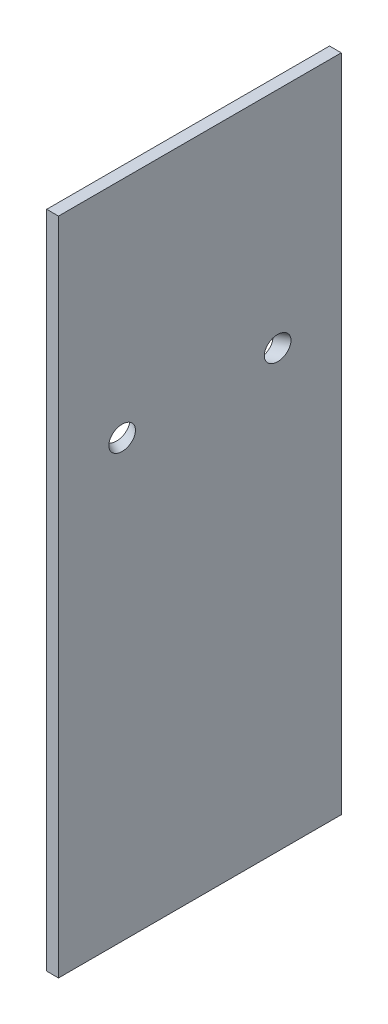
ISO-10303-21;
HEADER;
FILE_DESCRIPTION(('STEP AP214'),'2;1');
FILE_NAME('part.step','',(''),(''),'','','');
FILE_SCHEMA(('AUTOMOTIVE_DESIGN { 1 0 10303 214 1 1 1 1 }'));
ENDSEC;
DATA;
#1=APPLICATION_CONTEXT('core data for automotive mechanical design processes');
#2=APPLICATION_PROTOCOL_DEFINITION('international standard','automotive_design',2000,#1);
#3=PRODUCT_CONTEXT('',#1,'mechanical');
#4=PRODUCT('Part','Part','',(#3));
#5=PRODUCT_RELATED_PRODUCT_CATEGORY('part','',(#4));
#6=PRODUCT_DEFINITION_FORMATION('','',#4);
#7=PRODUCT_DEFINITION_CONTEXT('part definition',#1,'design');
#8=PRODUCT_DEFINITION('design','',#6,#7);
#9=PRODUCT_DEFINITION_SHAPE('','',#8);
#10=(LENGTH_UNIT() NAMED_UNIT(*) SI_UNIT(.MILLI.,.METRE.));
#11=(NAMED_UNIT(*) PLANE_ANGLE_UNIT() SI_UNIT($,.RADIAN.));
#12=(NAMED_UNIT(*) SI_UNIT($,.STERADIAN.) SOLID_ANGLE_UNIT());
#13=UNCERTAINTY_MEASURE_WITH_UNIT(LENGTH_MEASURE(1.E-05),#10,'distance_accuracy_value','');
#14=(GEOMETRIC_REPRESENTATION_CONTEXT(3) GLOBAL_UNCERTAINTY_ASSIGNED_CONTEXT((#13)) GLOBAL_UNIT_ASSIGNED_CONTEXT((#10,
#11,#12)) REPRESENTATION_CONTEXT('',''));
#15=CARTESIAN_POINT('',(0.,0.,0.));
#16=DIRECTION('',(0.,0.,1.));
#17=DIRECTION('',(1.,0.,0.));
#18=AXIS2_PLACEMENT_3D('',#15,#16,#17);
#19=CARTESIAN_POINT('',(6.35,355.6,-152.4));
#20=DIRECTION('',(0.,0.,1.));
#21=DIRECTION('',(0.,-1.,0.));
#22=AXIS2_PLACEMENT_3D('',#19,#20,#21);
#23=PLANE('',#22);
#24=DIRECTION('',(0.,1.,0.));
#25=VECTOR('',#24,1.);
#26=CARTESIAN_POINT('',(-6.35,355.6,-152.4));
#27=LINE('',#26,#25);
#28=CARTESIAN_POINT('',(-6.35,-355.6,-152.4));
#29=VERTEX_POINT('',#28);
#30=CARTESIAN_POINT('',(-6.35,355.6,-152.4));
#31=VERTEX_POINT('',#30);
#32=EDGE_CURVE('E115',#29,#31,#27,.T.);
#33=ORIENTED_EDGE('',*,*,#32,.T.);
#34=DIRECTION('',(-1.,0.,0.));
#35=VECTOR('',#34,1.);
#36=CARTESIAN_POINT('',(6.35,355.6,-152.4));
#37=LINE('',#36,#35);
#38=CARTESIAN_POINT('',(6.35,355.6,-152.4));
#39=VERTEX_POINT('',#38);
#40=EDGE_CURVE('E102',#39,#31,#37,.T.);
#41=ORIENTED_EDGE('',*,*,#40,.F.);
#42=DIRECTION('',(0.,1.,0.));
#43=VECTOR('',#42,1.);
#44=CARTESIAN_POINT('',(6.35,355.6,-152.4));
#45=LINE('',#44,#43);
#46=CARTESIAN_POINT('',(6.35,-355.6,-152.4));
#47=VERTEX_POINT('',#46);
#48=EDGE_CURVE('E121',#47,#39,#45,.T.);
#49=ORIENTED_EDGE('',*,*,#48,.F.);
#50=DIRECTION('',(-1.,0.,0.));
#51=VECTOR('',#50,1.);
#52=CARTESIAN_POINT('',(6.35,-355.6,-152.4));
#53=LINE('',#52,#51);
#54=EDGE_CURVE('E104',#47,#29,#53,.T.);
#55=ORIENTED_EDGE('',*,*,#54,.T.);
#56=EDGE_LOOP('',(#33,#41,#49,#55));
#57=FACE_BOUND('',#56,.T.);
#58=ADVANCED_FACE('F46',(#57),#23,.F.);
#59=CARTESIAN_POINT('',(6.35,355.6,152.4));
#60=DIRECTION('',(0.,-1.,0.));
#61=DIRECTION('',(0.,0.,-1.));
#62=AXIS2_PLACEMENT_3D('',#59,#60,#61);
#63=PLANE('',#62);
#64=DIRECTION('',(0.,0.,1.));
#65=VECTOR('',#64,1.);
#66=CARTESIAN_POINT('',(-6.35,355.6,152.4));
#67=LINE('',#66,#65);
#68=CARTESIAN_POINT('',(-6.35,355.6,152.4));
#69=VERTEX_POINT('',#68);
#70=EDGE_CURVE('E65',#31,#69,#67,.T.);
#71=ORIENTED_EDGE('',*,*,#70,.T.);
#72=DIRECTION('',(-1.,0.,0.));
#73=VECTOR('',#72,1.);
#74=CARTESIAN_POINT('',(6.35,355.6,152.4));
#75=LINE('',#74,#73);
#76=CARTESIAN_POINT('',(6.35,355.6,152.4));
#77=VERTEX_POINT('',#76);
#78=EDGE_CURVE('E99',#77,#69,#75,.T.);
#79=ORIENTED_EDGE('',*,*,#78,.F.);
#80=DIRECTION('',(0.,0.,1.));
#81=VECTOR('',#80,1.);
#82=CARTESIAN_POINT('',(6.35,355.6,152.4));
#83=LINE('',#82,#81);
#84=EDGE_CURVE('E81',#39,#77,#83,.T.);
#85=ORIENTED_EDGE('',*,*,#84,.F.);
#86=ORIENTED_EDGE('',*,*,#40,.T.);
#87=EDGE_LOOP('',(#71,#79,#85,#86));
#88=FACE_BOUND('',#87,.T.);
#89=ADVANCED_FACE('F98',(#88),#63,.F.);
#90=CARTESIAN_POINT('',(6.35,355.6,152.4));
#91=DIRECTION('',(0.,0.,-1.));
#92=DIRECTION('',(0.,1.,0.));
#93=AXIS2_PLACEMENT_3D('',#90,#91,#92);
#94=PLANE('',#93);
#95=DIRECTION('',(0.,-1.,0.));
#96=VECTOR('',#95,1.);
#97=CARTESIAN_POINT('',(-6.35,355.6,152.4));
#98=LINE('',#97,#96);
#99=CARTESIAN_POINT('',(-6.35,-355.6,152.4));
#100=VERTEX_POINT('',#99);
#101=EDGE_CURVE('E96',#69,#100,#98,.T.);
#102=ORIENTED_EDGE('',*,*,#101,.T.);
#103=DIRECTION('',(-1.,0.,0.));
#104=VECTOR('',#103,1.);
#105=CARTESIAN_POINT('',(6.35,-355.6,152.4));
#106=LINE('',#105,#104);
#107=CARTESIAN_POINT('',(6.35,-355.6,152.4));
#108=VERTEX_POINT('',#107);
#109=EDGE_CURVE('E124',#108,#100,#106,.T.);
#110=ORIENTED_EDGE('',*,*,#109,.F.);
#111=DIRECTION('',(0.,-1.,0.));
#112=VECTOR('',#111,1.);
#113=CARTESIAN_POINT('',(6.35,355.6,152.4));
#114=LINE('',#113,#112);
#115=EDGE_CURVE('E107',#77,#108,#114,.T.);
#116=ORIENTED_EDGE('',*,*,#115,.F.);
#117=ORIENTED_EDGE('',*,*,#78,.T.);
#118=EDGE_LOOP('',(#102,#110,#116,#117));
#119=FACE_BOUND('',#118,.T.);
#120=ADVANCED_FACE('F106',(#119),#94,.F.);
#121=CARTESIAN_POINT('',(6.35,-355.6,152.4));
#122=DIRECTION('',(0.,1.,0.));
#123=DIRECTION('',(0.,0.,1.));
#124=AXIS2_PLACEMENT_3D('',#121,#122,#123);
#125=PLANE('',#124);
#126=DIRECTION('',(0.,0.,-1.));
#127=VECTOR('',#126,1.);
#128=CARTESIAN_POINT('',(-6.35,-355.6,152.4));
#129=LINE('',#128,#127);
#130=EDGE_CURVE('E90',#100,#29,#129,.T.);
#131=ORIENTED_EDGE('',*,*,#130,.T.);
#132=ORIENTED_EDGE('',*,*,#54,.F.);
#133=DIRECTION('',(0.,0.,-1.));
#134=VECTOR('',#133,1.);
#135=CARTESIAN_POINT('',(6.35,-355.6,152.4));
#136=LINE('',#135,#134);
#137=EDGE_CURVE('E117',#108,#47,#136,.T.);
#138=ORIENTED_EDGE('',*,*,#137,.F.);
#139=ORIENTED_EDGE('',*,*,#109,.T.);
#140=EDGE_LOOP('',(#131,#132,#138,#139));
#141=FACE_BOUND('',#140,.T.);
#142=ADVANCED_FACE('F132',(#141),#125,.F.);
#143=CARTESIAN_POINT('',(6.35,0.,0.));
#144=DIRECTION('',(1.,0.,0.));
#145=DIRECTION('',(0.,0.,-1.));
#146=AXIS2_PLACEMENT_3D('',#143,#144,#145);
#147=PLANE('',#146);
#148=CARTESIAN_POINT('',(6.34999999999997,114.3,83.7861111111034));
#149=DIRECTION('',(1.,0.,0.));
#150=DIRECTION('',(0.,0.,1.));
#151=AXIS2_PLACEMENT_3D('',#148,#149,#150);
#152=ELLIPSE('',#151,14.3602656639171,12.7);
#153=CARTESIAN_POINT('',(6.34999999999997,114.3,98.1463767750204));
#154=VERTEX_POINT('',#153);
#155=EDGE_CURVE('E122',#154,#154,#152,.F.);
#156=ORIENTED_EDGE('',*,*,#155,.T.);
#157=EDGE_LOOP('',(#156));
#158=FACE_BOUND('',#157,.T.);
#159=CARTESIAN_POINT('',(6.35000000000002,114.3,-83.7861111111047));
#160=DIRECTION('',(1.,0.,0.));
#161=DIRECTION('',(0.,0.,1.));
#162=AXIS2_PLACEMENT_3D('',#159,#160,#161);
#163=ELLIPSE('',#162,14.360265663917,12.7);
#164=CARTESIAN_POINT('',(6.35000000000002,114.3,-69.4258454471876));
#165=VERTEX_POINT('',#164);
#166=EDGE_CURVE('E50',#165,#165,#163,.F.);
#167=ORIENTED_EDGE('',*,*,#166,.T.);
#168=EDGE_LOOP('',(#167));
#169=FACE_BOUND('',#168,.T.);
#170=ORIENTED_EDGE('',*,*,#48,.T.);
#171=ORIENTED_EDGE('',*,*,#84,.T.);
#172=ORIENTED_EDGE('',*,*,#115,.T.);
#173=ORIENTED_EDGE('',*,*,#137,.T.);
#174=EDGE_LOOP('',(#170,#171,#172,#173));
#175=FACE_BOUND('',#174,.T.);
#176=ADVANCED_FACE('F48',(#158,#169,#175),#147,.T.);
#177=CARTESIAN_POINT('',(-6.35,0.,0.));
#178=DIRECTION('',(1.,0.,0.));
#179=DIRECTION('',(0.,0.,-1.));
#180=AXIS2_PLACEMENT_3D('',#177,#178,#179);
#181=PLANE('',#180);
#182=CARTESIAN_POINT('',(-6.34999999999997,114.3,77.0833333333254));
#183=DIRECTION('',(1.,0.,0.));
#184=DIRECTION('',(0.,0.,1.));
#185=AXIS2_PLACEMENT_3D('',#182,#183,#184);
#186=ELLIPSE('',#185,14.3602656639171,12.7);
#187=CARTESIAN_POINT('',(-6.34999999999997,114.3,91.4435989972425));
#188=VERTEX_POINT('',#187);
#189=EDGE_CURVE('E11',#188,#188,#186,.F.);
#190=ORIENTED_EDGE('',*,*,#189,.F.);
#191=EDGE_LOOP('',(#190));
#192=FACE_BOUND('',#191,.T.);
#193=CARTESIAN_POINT('',(-6.35000000000002,114.3,-77.0833333333266));
#194=DIRECTION('',(1.,0.,0.));
#195=DIRECTION('',(0.,0.,1.));
#196=AXIS2_PLACEMENT_3D('',#193,#194,#195);
#197=ELLIPSE('',#196,14.360265663917,12.7);
#198=CARTESIAN_POINT('',(-6.35000000000002,114.3,-62.7230676694096));
#199=VERTEX_POINT('',#198);
#200=EDGE_CURVE('E56',#199,#199,#197,.F.);
#201=ORIENTED_EDGE('',*,*,#200,.F.);
#202=EDGE_LOOP('',(#201));
#203=FACE_BOUND('',#202,.T.);
#204=ORIENTED_EDGE('',*,*,#32,.F.);
#205=ORIENTED_EDGE('',*,*,#130,.F.);
#206=ORIENTED_EDGE('',*,*,#101,.F.);
#207=ORIENTED_EDGE('',*,*,#70,.F.);
#208=EDGE_LOOP('',(#204,#205,#206,#207));
#209=FACE_BOUND('',#208,.T.);
#210=ADVANCED_FACE('F109',(#192,#203,#209),#181,.F.);
#211=CARTESIAN_POINT('',(368.65,114.299999999998,-275.));
#212=DIRECTION('',(-0.884384752846963,0.,0.466758619558136));
#213=DIRECTION('',(0.466758619558136,0.,0.884384752846963));
#214=AXIS2_PLACEMENT_3D('',#211,#212,#213);
#215=CYLINDRICAL_SURFACE('',#214,12.7);
#216=ORIENTED_EDGE('',*,*,#166,.F.);
#217=EDGE_LOOP('',(#216));
#218=FACE_BOUND('',#217,.T.);
#219=ORIENTED_EDGE('',*,*,#200,.T.);
#220=EDGE_LOOP('',(#219));
#221=FACE_BOUND('',#220,.T.);
#222=ADVANCED_FACE('F138',(#218,#221),#215,.F.);
#223=CARTESIAN_POINT('',(-531.349999999963,114.300000000003,-200.));
#224=DIRECTION('',(0.884384752846962,0.,0.466758619558138));
#225=DIRECTION('',(0.466758619558138,0.,-0.884384752846962));
#226=AXIS2_PLACEMENT_3D('',#223,#224,#225);
#227=CYLINDRICAL_SURFACE('',#226,12.7);
#228=ORIENTED_EDGE('',*,*,#155,.F.);
#229=EDGE_LOOP('',(#228));
#230=FACE_BOUND('',#229,.T.);
#231=ORIENTED_EDGE('',*,*,#189,.T.);
#232=EDGE_LOOP('',(#231));
#233=FACE_BOUND('',#232,.T.);
#234=ADVANCED_FACE('F153',(#230,#233),#227,.F.);
#235=CLOSED_SHELL('',(#58,#89,#120,#142,#176,#210,#222,#234));
#236=MANIFOLD_SOLID_BREP('B2',#235);
#237=ADVANCED_BREP_SHAPE_REPRESENTATION('',(#18,#236),#14);
#238=SHAPE_DEFINITION_REPRESENTATION(#9,#237);
ENDSEC;
END-ISO-10303-21;
